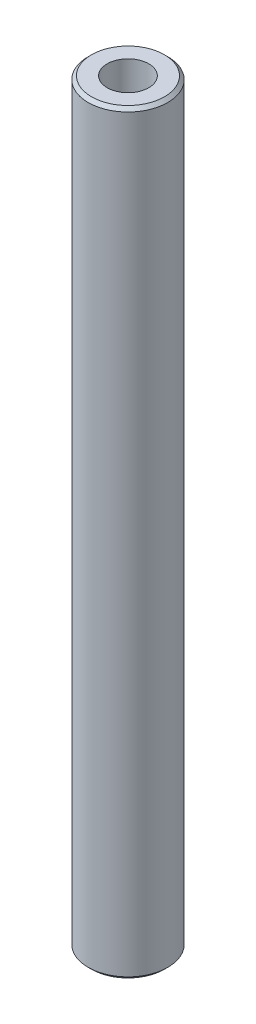
ISO-10303-21;
HEADER;
FILE_DESCRIPTION(('STEP AP214'),'2;1');
FILE_NAME('part.step','',(''),(''),'','','');
FILE_SCHEMA(('AUTOMOTIVE_DESIGN { 1 0 10303 214 1 1 1 1 }'));
ENDSEC;
DATA;
#1=APPLICATION_CONTEXT('core data for automotive mechanical design processes');
#2=APPLICATION_PROTOCOL_DEFINITION('international standard','automotive_design',2000,#1);
#3=PRODUCT_CONTEXT('',#1,'mechanical');
#4=PRODUCT('Part','Part','',(#3));
#5=PRODUCT_RELATED_PRODUCT_CATEGORY('part','',(#4));
#6=PRODUCT_DEFINITION_FORMATION('','',#4);
#7=PRODUCT_DEFINITION_CONTEXT('part definition',#1,'design');
#8=PRODUCT_DEFINITION('design','',#6,#7);
#9=PRODUCT_DEFINITION_SHAPE('','',#8);
#10=(LENGTH_UNIT() NAMED_UNIT(*) SI_UNIT(.MILLI.,.METRE.));
#11=(NAMED_UNIT(*) PLANE_ANGLE_UNIT() SI_UNIT($,.RADIAN.));
#12=(NAMED_UNIT(*) SI_UNIT($,.STERADIAN.) SOLID_ANGLE_UNIT());
#13=UNCERTAINTY_MEASURE_WITH_UNIT(LENGTH_MEASURE(1.E-05),#10,'distance_accuracy_value','');
#14=(GEOMETRIC_REPRESENTATION_CONTEXT(3) GLOBAL_UNCERTAINTY_ASSIGNED_CONTEXT((#13)) GLOBAL_UNIT_ASSIGNED_CONTEXT((#10,
#11,#12)) REPRESENTATION_CONTEXT('',''));
#15=CARTESIAN_POINT('',(0.,0.,0.));
#16=DIRECTION('',(0.,0.,1.));
#17=DIRECTION('',(1.,0.,0.));
#18=AXIS2_PLACEMENT_3D('',#15,#16,#17);
#19=CARTESIAN_POINT('',(0.,45.24375,0.));
#20=DIRECTION('',(0.,-1.,0.));
#21=DIRECTION('',(0.,0.,-1.));
#22=AXIS2_PLACEMENT_3D('',#19,#20,#21);
#23=CYLINDRICAL_SURFACE('',#22,4.7625);
#24=CARTESIAN_POINT('',(0.,-44.846875,0.));
#25=DIRECTION('',(0.,1.,0.));
#26=DIRECTION('',(0.,0.,1.));
#27=AXIS2_PLACEMENT_3D('',#24,#25,#26);
#28=CIRCLE('',#27,4.7625);
#29=CARTESIAN_POINT('',(0.,-44.846875,4.7625));
#30=VERTEX_POINT('',#29);
#31=EDGE_CURVE('E45',#30,#30,#28,.T.);
#32=ORIENTED_EDGE('',*,*,#31,.T.);
#33=EDGE_LOOP('',(#32));
#34=FACE_BOUND('',#33,.T.);
#35=CARTESIAN_POINT('',(0.,44.846875,0.));
#36=DIRECTION('',(0.,1.,0.));
#37=DIRECTION('',(0.,0.,1.));
#38=AXIS2_PLACEMENT_3D('',#35,#36,#37);
#39=CIRCLE('',#38,4.7625);
#40=CARTESIAN_POINT('',(0.,44.846875,4.7625));
#41=VERTEX_POINT('',#40);
#42=EDGE_CURVE('E49',#41,#41,#39,.F.);
#43=ORIENTED_EDGE('',*,*,#42,.T.);
#44=EDGE_LOOP('',(#43));
#45=FACE_BOUND('',#44,.T.);
#46=ADVANCED_FACE('F33',(#34,#45),#23,.T.);
#47=CARTESIAN_POINT('',(0.,45.24375,0.));
#48=DIRECTION('',(0.,1.,0.));
#49=DIRECTION('',(0.,0.,1.));
#50=AXIS2_PLACEMENT_3D('',#47,#48,#49);
#51=PLANE('',#50);
#52=CARTESIAN_POINT('',(0.,45.24375,0.));
#53=DIRECTION('',(0.,1.,0.));
#54=DIRECTION('',(0.,0.,1.));
#55=AXIS2_PLACEMENT_3D('',#52,#53,#54);
#56=CIRCLE('',#55,2.4892);
#57=CARTESIAN_POINT('',(0.,45.24375,2.4892));
#58=VERTEX_POINT('',#57);
#59=EDGE_CURVE('E57',#58,#58,#56,.T.);
#60=ORIENTED_EDGE('',*,*,#59,.F.);
#61=EDGE_LOOP('',(#60));
#62=FACE_BOUND('',#61,.T.);
#63=CARTESIAN_POINT('',(0.,45.24375,0.));
#64=DIRECTION('',(0.,1.,0.));
#65=DIRECTION('',(0.,0.,1.));
#66=AXIS2_PLACEMENT_3D('',#63,#64,#65);
#67=CIRCLE('',#66,4.36562500000001);
#68=CARTESIAN_POINT('',(0.,45.24375,4.36562500000001));
#69=VERTEX_POINT('',#68);
#70=EDGE_CURVE('E10',#69,#69,#67,.T.);
#71=ORIENTED_EDGE('',*,*,#70,.T.);
#72=EDGE_LOOP('',(#71));
#73=FACE_BOUND('',#72,.T.);
#74=ADVANCED_FACE('F63',(#62,#73),#51,.T.);
#75=CARTESIAN_POINT('',(0.,-45.24375,0.));
#76=DIRECTION('',(0.,1.,0.));
#77=DIRECTION('',(0.,0.,1.));
#78=AXIS2_PLACEMENT_3D('',#75,#76,#77);
#79=PLANE('',#78);
#80=CARTESIAN_POINT('',(0.,-45.24375,0.));
#81=DIRECTION('',(0.,1.,0.));
#82=DIRECTION('',(0.,0.,1.));
#83=AXIS2_PLACEMENT_3D('',#80,#81,#82);
#84=CIRCLE('',#83,2.4892);
#85=CARTESIAN_POINT('',(0.,-45.24375,2.4892));
#86=VERTEX_POINT('',#85);
#87=EDGE_CURVE('E54',#86,#86,#84,.T.);
#88=ORIENTED_EDGE('',*,*,#87,.T.);
#89=EDGE_LOOP('',(#88));
#90=FACE_BOUND('',#89,.T.);
#91=CARTESIAN_POINT('',(0.,-45.24375,0.));
#92=DIRECTION('',(0.,1.,0.));
#93=DIRECTION('',(0.,0.,1.));
#94=AXIS2_PLACEMENT_3D('',#91,#92,#93);
#95=CIRCLE('',#94,4.36562500000002);
#96=CARTESIAN_POINT('',(0.,-45.24375,4.36562500000002));
#97=VERTEX_POINT('',#96);
#98=EDGE_CURVE('E41',#97,#97,#95,.F.);
#99=ORIENTED_EDGE('',*,*,#98,.T.);
#100=EDGE_LOOP('',(#99));
#101=FACE_BOUND('',#100,.T.);
#102=ADVANCED_FACE('F65',(#90,#101),#79,.F.);
#103=CARTESIAN_POINT('',(0.,-44.846875,0.));
#104=DIRECTION('',(0.,1.,0.));
#105=DIRECTION('',(0.,0.,1.));
#106=AXIS2_PLACEMENT_3D('',#103,#104,#105);
#107=CONICAL_SURFACE('',#106,4.7625,0.785398163397436);
#108=ORIENTED_EDGE('',*,*,#98,.F.);
#109=EDGE_LOOP('',(#108));
#110=FACE_BOUND('',#109,.T.);
#111=ORIENTED_EDGE('',*,*,#31,.F.);
#112=EDGE_LOOP('',(#111));
#113=FACE_BOUND('',#112,.T.);
#114=ADVANCED_FACE('F71',(#110,#113),#107,.T.);
#115=CARTESIAN_POINT('',(0.,45.24375,0.));
#116=DIRECTION('',(0.,-1.,0.));
#117=DIRECTION('',(0.,0.,-1.));
#118=AXIS2_PLACEMENT_3D('',#115,#116,#117);
#119=CONICAL_SURFACE('',#118,4.36562500000001,0.785398163397436);
#120=ORIENTED_EDGE('',*,*,#42,.F.);
#121=EDGE_LOOP('',(#120));
#122=FACE_BOUND('',#121,.T.);
#123=ORIENTED_EDGE('',*,*,#70,.F.);
#124=EDGE_LOOP('',(#123));
#125=FACE_BOUND('',#124,.T.);
#126=ADVANCED_FACE('F36',(#122,#125),#119,.T.);
#127=CARTESIAN_POINT('',(0.,-45.24375,0.));
#128=DIRECTION('',(0.,1.,0.));
#129=DIRECTION('',(0.,0.,1.));
#130=AXIS2_PLACEMENT_3D('',#127,#128,#129);
#131=CYLINDRICAL_SURFACE('',#130,2.4892);
#132=ORIENTED_EDGE('',*,*,#87,.F.);
#133=EDGE_LOOP('',(#132));
#134=FACE_BOUND('',#133,.T.);
#135=ORIENTED_EDGE('',*,*,#59,.T.);
#136=EDGE_LOOP('',(#135));
#137=FACE_BOUND('',#136,.T.);
#138=ADVANCED_FACE('F61',(#134,#137),#131,.F.);
#139=CLOSED_SHELL('',(#46,#74,#102,#114,#126,#138));
#140=MANIFOLD_SOLID_BREP('B2',#139);
#141=ADVANCED_BREP_SHAPE_REPRESENTATION('',(#18,#140),#14);
#142=SHAPE_DEFINITION_REPRESENTATION(#9,#141);
ENDSEC;
END-ISO-10303-21;
